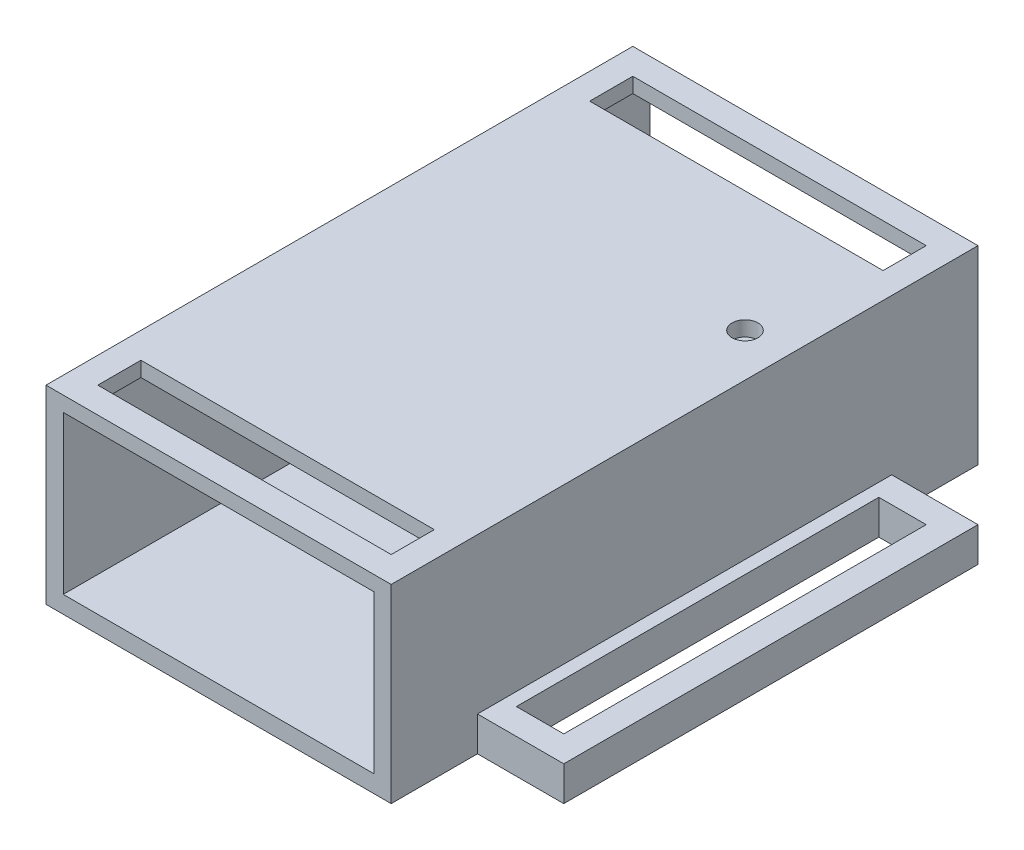
ISO-10303-21;
HEADER;
FILE_DESCRIPTION(('STEP AP214'),'2;1');
FILE_NAME('part.step','',(''),(''),'','','');
FILE_SCHEMA(('AUTOMOTIVE_DESIGN { 1 0 10303 214 1 1 1 1 }'));
ENDSEC;
DATA;
#1=APPLICATION_CONTEXT('core data for automotive mechanical design processes');
#2=APPLICATION_PROTOCOL_DEFINITION('international standard','automotive_design',2000,#1);
#3=PRODUCT_CONTEXT('',#1,'mechanical');
#4=PRODUCT('Part','Part','',(#3));
#5=PRODUCT_RELATED_PRODUCT_CATEGORY('part','',(#4));
#6=PRODUCT_DEFINITION_FORMATION('','',#4);
#7=PRODUCT_DEFINITION_CONTEXT('part definition',#1,'design');
#8=PRODUCT_DEFINITION('design','',#6,#7);
#9=PRODUCT_DEFINITION_SHAPE('','',#8);
#10=(LENGTH_UNIT() NAMED_UNIT(*) SI_UNIT(.MILLI.,.METRE.));
#11=(NAMED_UNIT(*) PLANE_ANGLE_UNIT() SI_UNIT($,.RADIAN.));
#12=(NAMED_UNIT(*) SI_UNIT($,.STERADIAN.) SOLID_ANGLE_UNIT());
#13=UNCERTAINTY_MEASURE_WITH_UNIT(LENGTH_MEASURE(1.E-05),#10,'distance_accuracy_value','');
#14=(GEOMETRIC_REPRESENTATION_CONTEXT(3) GLOBAL_UNCERTAINTY_ASSIGNED_CONTEXT((#13)) GLOBAL_UNIT_ASSIGNED_CONTEXT((#10,
#11,#12)) REPRESENTATION_CONTEXT('',''));
#15=CARTESIAN_POINT('',(0.,0.,0.));
#16=DIRECTION('',(0.,0.,1.));
#17=DIRECTION('',(1.,0.,0.));
#18=AXIS2_PLACEMENT_3D('',#15,#16,#17);
#19=CARTESIAN_POINT('',(0.,0.,0.));
#20=DIRECTION('',(0.,1.,0.));
#21=DIRECTION('',(0.,0.,1.));
#22=AXIS2_PLACEMENT_3D('',#19,#20,#21);
#23=PLANE('',#22);
#24=CARTESIAN_POINT('',(35.,0.,22.));
#25=DIRECTION('',(0.,1.,0.));
#26=DIRECTION('',(0.,0.,1.));
#27=AXIS2_PLACEMENT_3D('',#24,#25,#26);
#28=CIRCLE('',#27,1.5);
#29=CARTESIAN_POINT('',(35.,0.,23.5));
#30=VERTEX_POINT('',#29);
#31=EDGE_CURVE('E406',#30,#30,#28,.T.);
#32=ORIENTED_EDGE('',*,*,#31,.T.);
#33=EDGE_LOOP('',(#32));
#34=FACE_BOUND('',#33,.T.);
#35=DIRECTION('',(0.,0.,1.));
#36=VECTOR('',#35,1.);
#37=CARTESIAN_POINT('',(0.,0.,0.));
#38=LINE('',#37,#36);
#39=CARTESIAN_POINT('',(0.,0.,0.));
#40=VERTEX_POINT('',#39);
#41=CARTESIAN_POINT('',(0.,0.,10.));
#42=VERTEX_POINT('',#41);
#43=EDGE_CURVE('E357',#40,#42,#38,.T.);
#44=ORIENTED_EDGE('',*,*,#43,.F.);
#45=DIRECTION('',(-1.,0.,0.));
#46=VECTOR('',#45,1.);
#47=CARTESIAN_POINT('',(0.,0.,0.));
#48=LINE('',#47,#46);
#49=CARTESIAN_POINT('',(40.,0.,0.));
#50=VERTEX_POINT('',#49);
#51=EDGE_CURVE('E374',#50,#40,#48,.T.);
#52=ORIENTED_EDGE('',*,*,#51,.F.);
#53=DIRECTION('',(0.,0.,-1.));
#54=VECTOR('',#53,1.);
#55=CARTESIAN_POINT('',(40.,0.,0.));
#56=LINE('',#55,#54);
#57=CARTESIAN_POINT('',(40.,0.,10.));
#58=VERTEX_POINT('',#57);
#59=EDGE_CURVE('E371',#58,#50,#56,.T.);
#60=ORIENTED_EDGE('',*,*,#59,.F.);
#61=DIRECTION('',(-1.,0.,0.));
#62=VECTOR('',#61,1.);
#63=CARTESIAN_POINT('',(50.,0.,10.));
#64=LINE('',#63,#62);
#65=CARTESIAN_POINT('',(50.,0.,10.));
#66=VERTEX_POINT('',#65);
#67=EDGE_CURVE('E514',#66,#58,#64,.T.);
#68=ORIENTED_EDGE('',*,*,#67,.F.);
#69=DIRECTION('',(0.,0.,-1.));
#70=VECTOR('',#69,1.);
#71=CARTESIAN_POINT('',(50.,0.,58.));
#72=LINE('',#71,#70);
#73=CARTESIAN_POINT('',(50.,0.,58.));
#74=VERTEX_POINT('',#73);
#75=EDGE_CURVE('E339',#74,#66,#72,.T.);
#76=ORIENTED_EDGE('',*,*,#75,.F.);
#77=DIRECTION('',(-1.,0.,0.));
#78=VECTOR('',#77,1.);
#79=CARTESIAN_POINT('',(50.,0.,58.));
#80=LINE('',#79,#78);
#81=CARTESIAN_POINT('',(40.,0.,58.));
#82=VERTEX_POINT('',#81);
#83=EDGE_CURVE('E511',#74,#82,#80,.T.);
#84=ORIENTED_EDGE('',*,*,#83,.T.);
#85=CARTESIAN_POINT('',(40.,0.,68.));
#86=VERTEX_POINT('',#85);
#87=EDGE_CURVE('E380',#86,#82,#56,.T.);
#88=ORIENTED_EDGE('',*,*,#87,.F.);
#89=DIRECTION('',(1.,0.,0.));
#90=VECTOR('',#89,1.);
#91=CARTESIAN_POINT('',(0.,0.,68.));
#92=LINE('',#91,#90);
#93=CARTESIAN_POINT('',(0.,0.,68.));
#94=VERTEX_POINT('',#93);
#95=EDGE_CURVE('E361',#94,#86,#92,.T.);
#96=ORIENTED_EDGE('',*,*,#95,.F.);
#97=CARTESIAN_POINT('',(0.,0.,58.));
#98=VERTEX_POINT('',#97);
#99=EDGE_CURVE('E362',#98,#94,#38,.T.);
#100=ORIENTED_EDGE('',*,*,#99,.F.);
#101=DIRECTION('',(1.,0.,0.));
#102=VECTOR('',#101,1.);
#103=CARTESIAN_POINT('',(-10.,0.,58.));
#104=LINE('',#103,#102);
#105=CARTESIAN_POINT('',(-10.,0.,58.));
#106=VERTEX_POINT('',#105);
#107=EDGE_CURVE('E291',#106,#98,#104,.T.);
#108=ORIENTED_EDGE('',*,*,#107,.F.);
#109=DIRECTION('',(0.,0.,-1.));
#110=VECTOR('',#109,1.);
#111=CARTESIAN_POINT('',(-10.,0.,58.));
#112=LINE('',#111,#110);
#113=CARTESIAN_POINT('',(-10.,0.,10.));
#114=VERTEX_POINT('',#113);
#115=EDGE_CURVE('E289',#106,#114,#112,.T.);
#116=ORIENTED_EDGE('',*,*,#115,.T.);
#117=DIRECTION('',(1.,0.,0.));
#118=VECTOR('',#117,1.);
#119=CARTESIAN_POINT('',(-10.,0.,10.));
#120=LINE('',#119,#118);
#121=EDGE_CURVE('E300',#114,#42,#120,.T.);
#122=ORIENTED_EDGE('',*,*,#121,.T.);
#123=EDGE_LOOP('',(#44,#52,#60,#68,#76,#84,#88,#96,#100,#108,#116,#122));
#124=FACE_BOUND('',#123,.T.);
#125=DIRECTION('',(-1.,0.,0.));
#126=VECTOR('',#125,1.);
#127=CARTESIAN_POINT('',(0.,0.,13.));
#128=LINE('',#127,#126);
#129=CARTESIAN_POINT('',(47.,0.,13.));
#130=VERTEX_POINT('',#129);
#131=CARTESIAN_POINT('',(41.5091091487596,0.,13.));
#132=VERTEX_POINT('',#131);
#133=EDGE_CURVE('E329',#130,#132,#128,.T.);
#134=ORIENTED_EDGE('',*,*,#133,.T.);
#135=DIRECTION('',(0.,0.,1.));
#136=VECTOR('',#135,1.);
#137=CARTESIAN_POINT('',(41.5091091487596,0.,0.));
#138=LINE('',#137,#136);
#139=CARTESIAN_POINT('',(41.5091091487596,0.,55.));
#140=VERTEX_POINT('',#139);
#141=EDGE_CURVE('E332',#132,#140,#138,.T.);
#142=ORIENTED_EDGE('',*,*,#141,.T.);
#143=DIRECTION('',(1.,0.,0.));
#144=VECTOR('',#143,1.);
#145=CARTESIAN_POINT('',(0.,0.,55.));
#146=LINE('',#145,#144);
#147=CARTESIAN_POINT('',(47.,0.,55.));
#148=VERTEX_POINT('',#147);
#149=EDGE_CURVE('E317',#140,#148,#146,.T.);
#150=ORIENTED_EDGE('',*,*,#149,.T.);
#151=DIRECTION('',(0.,0.,-1.));
#152=VECTOR('',#151,1.);
#153=CARTESIAN_POINT('',(47.,0.,0.));
#154=LINE('',#153,#152);
#155=EDGE_CURVE('E326',#148,#130,#154,.T.);
#156=ORIENTED_EDGE('',*,*,#155,.T.);
#157=EDGE_LOOP('',(#134,#142,#150,#156));
#158=FACE_BOUND('',#157,.T.);
#159=DIRECTION('',(0.,0.,1.));
#160=VECTOR('',#159,1.);
#161=CARTESIAN_POINT('',(-1.50910914875956,0.,0.));
#162=LINE('',#161,#160);
#163=CARTESIAN_POINT('',(-1.50910914875956,0.,13.));
#164=VERTEX_POINT('',#163);
#165=CARTESIAN_POINT('',(-1.50910914875956,0.,55.));
#166=VERTEX_POINT('',#165);
#167=EDGE_CURVE('E277',#164,#166,#162,.T.);
#168=ORIENTED_EDGE('',*,*,#167,.F.);
#169=DIRECTION('',(1.,0.,0.));
#170=VECTOR('',#169,1.);
#171=CARTESIAN_POINT('',(0.,0.,13.));
#172=LINE('',#171,#170);
#173=CARTESIAN_POINT('',(-7.,0.,13.));
#174=VERTEX_POINT('',#173);
#175=EDGE_CURVE('E270',#174,#164,#172,.T.);
#176=ORIENTED_EDGE('',*,*,#175,.F.);
#177=DIRECTION('',(0.,0.,-1.));
#178=VECTOR('',#177,1.);
#179=CARTESIAN_POINT('',(-7.,0.,0.));
#180=LINE('',#179,#178);
#181=CARTESIAN_POINT('',(-7.00000000000001,0.,55.));
#182=VERTEX_POINT('',#181);
#183=EDGE_CURVE('E251',#182,#174,#180,.T.);
#184=ORIENTED_EDGE('',*,*,#183,.F.);
#185=DIRECTION('',(-1.,0.,0.));
#186=VECTOR('',#185,1.);
#187=CARTESIAN_POINT('',(0.,0.,55.));
#188=LINE('',#187,#186);
#189=EDGE_CURVE('E275',#166,#182,#188,.T.);
#190=ORIENTED_EDGE('',*,*,#189,.F.);
#191=EDGE_LOOP('',(#168,#176,#184,#190));
#192=FACE_BOUND('',#191,.T.);
#193=ADVANCED_FACE('F33',(#34,#124,#158,#192),#23,.F.);
#194=CARTESIAN_POINT('',(-10.,4.,58.));
#195=DIRECTION('',(0.,1.,0.));
#196=DIRECTION('',(0.,0.,1.));
#197=AXIS2_PLACEMENT_3D('',#194,#195,#196);
#198=PLANE('',#197);
#199=DIRECTION('',(0.,0.,1.));
#200=VECTOR('',#199,1.);
#201=CARTESIAN_POINT('',(0.,4.,58.));
#202=LINE('',#201,#200);
#203=CARTESIAN_POINT('',(0.,4.,10.));
#204=VERTEX_POINT('',#203);
#205=CARTESIAN_POINT('',(0.,4.,58.));
#206=VERTEX_POINT('',#205);
#207=EDGE_CURVE('E294',#204,#206,#202,.T.);
#208=ORIENTED_EDGE('',*,*,#207,.F.);
#209=DIRECTION('',(1.,0.,0.));
#210=VECTOR('',#209,1.);
#211=CARTESIAN_POINT('',(-10.,4.,10.));
#212=LINE('',#211,#210);
#213=CARTESIAN_POINT('',(-10.,4.,10.));
#214=VERTEX_POINT('',#213);
#215=EDGE_CURVE('E297',#214,#204,#212,.T.);
#216=ORIENTED_EDGE('',*,*,#215,.F.);
#217=DIRECTION('',(0.,0.,1.));
#218=VECTOR('',#217,1.);
#219=CARTESIAN_POINT('',(-10.,4.,58.));
#220=LINE('',#219,#218);
#221=CARTESIAN_POINT('',(-10.,4.,58.));
#222=VERTEX_POINT('',#221);
#223=EDGE_CURVE('E282',#214,#222,#220,.T.);
#224=ORIENTED_EDGE('',*,*,#223,.T.);
#225=DIRECTION('',(1.,0.,0.));
#226=VECTOR('',#225,1.);
#227=CARTESIAN_POINT('',(-10.,4.,58.));
#228=LINE('',#227,#226);
#229=EDGE_CURVE('E299',#222,#206,#228,.T.);
#230=ORIENTED_EDGE('',*,*,#229,.T.);
#231=EDGE_LOOP('',(#208,#216,#224,#230));
#232=FACE_BOUND('',#231,.T.);
#233=DIRECTION('',(1.,0.,0.));
#234=VECTOR('',#233,1.);
#235=CARTESIAN_POINT('',(-1.50910914875956,4.,13.));
#236=LINE('',#235,#234);
#237=CARTESIAN_POINT('',(-7.,4.,13.));
#238=VERTEX_POINT('',#237);
#239=CARTESIAN_POINT('',(-1.50910914875956,4.,13.));
#240=VERTEX_POINT('',#239);
#241=EDGE_CURVE('E257',#238,#240,#236,.T.);
#242=ORIENTED_EDGE('',*,*,#241,.T.);
#243=DIRECTION('',(0.,0.,1.));
#244=VECTOR('',#243,1.);
#245=CARTESIAN_POINT('',(-1.50910914875956,4.,13.));
#246=LINE('',#245,#244);
#247=CARTESIAN_POINT('',(-1.50910914875956,4.,55.));
#248=VERTEX_POINT('',#247);
#249=EDGE_CURVE('E59',#240,#248,#246,.T.);
#250=ORIENTED_EDGE('',*,*,#249,.T.);
#251=DIRECTION('',(-1.,0.,0.));
#252=VECTOR('',#251,1.);
#253=CARTESIAN_POINT('',(-1.50910914875956,4.,55.));
#254=LINE('',#253,#252);
#255=CARTESIAN_POINT('',(-7.00000000000001,4.,55.));
#256=VERTEX_POINT('',#255);
#257=EDGE_CURVE('E263',#248,#256,#254,.T.);
#258=ORIENTED_EDGE('',*,*,#257,.T.);
#259=DIRECTION('',(0.,0.,-1.));
#260=VECTOR('',#259,1.);
#261=CARTESIAN_POINT('',(-7.,4.,13.));
#262=LINE('',#261,#260);
#263=EDGE_CURVE('E248',#256,#238,#262,.T.);
#264=ORIENTED_EDGE('',*,*,#263,.T.);
#265=EDGE_LOOP('',(#242,#250,#258,#264));
#266=FACE_BOUND('',#265,.T.);
#267=ADVANCED_FACE('F261',(#232,#266),#198,.T.);
#268=CARTESIAN_POINT('',(40.,22.,0.));
#269=DIRECTION('',(-1.,0.,0.));
#270=DIRECTION('',(0.,0.,1.));
#271=AXIS2_PLACEMENT_3D('',#268,#269,#270);
#272=PLANE('',#271);
#273=DIRECTION('',(0.,-1.,0.));
#274=VECTOR('',#273,1.);
#275=CARTESIAN_POINT('',(40.,4.,58.));
#276=LINE('',#275,#274);
#277=CARTESIAN_POINT('',(40.,4.,58.));
#278=VERTEX_POINT('',#277);
#279=EDGE_CURVE('E335',#278,#82,#276,.T.);
#280=ORIENTED_EDGE('',*,*,#279,.F.);
#281=DIRECTION('',(0.,0.,1.));
#282=VECTOR('',#281,1.);
#283=CARTESIAN_POINT('',(40.,4.,58.));
#284=LINE('',#283,#282);
#285=CARTESIAN_POINT('',(40.,4.,10.));
#286=VERTEX_POINT('',#285);
#287=EDGE_CURVE('E340',#286,#278,#284,.T.);
#288=ORIENTED_EDGE('',*,*,#287,.F.);
#289=DIRECTION('',(0.,1.,0.));
#290=VECTOR('',#289,1.);
#291=CARTESIAN_POINT('',(40.,4.,10.));
#292=LINE('',#291,#290);
#293=EDGE_CURVE('E354',#58,#286,#292,.T.);
#294=ORIENTED_EDGE('',*,*,#293,.F.);
#295=ORIENTED_EDGE('',*,*,#59,.T.);
#296=DIRECTION('',(0.,-1.,0.));
#297=VECTOR('',#296,1.);
#298=CARTESIAN_POINT('',(40.,22.,0.));
#299=LINE('',#298,#297);
#300=CARTESIAN_POINT('',(40.,22.,0.));
#301=VERTEX_POINT('',#300);
#302=EDGE_CURVE('E416',#301,#50,#299,.T.);
#303=ORIENTED_EDGE('',*,*,#302,.F.);
#304=DIRECTION('',(0.,0.,-1.));
#305=VECTOR('',#304,1.);
#306=CARTESIAN_POINT('',(40.,22.,0.));
#307=LINE('',#306,#305);
#308=CARTESIAN_POINT('',(40.,22.,68.));
#309=VERTEX_POINT('',#308);
#310=EDGE_CURVE('E424',#309,#301,#307,.T.);
#311=ORIENTED_EDGE('',*,*,#310,.F.);
#312=DIRECTION('',(0.,-1.,0.));
#313=VECTOR('',#312,1.);
#314=CARTESIAN_POINT('',(40.,22.,68.));
#315=LINE('',#314,#313);
#316=EDGE_CURVE('E413',#309,#86,#315,.T.);
#317=ORIENTED_EDGE('',*,*,#316,.T.);
#318=ORIENTED_EDGE('',*,*,#87,.T.);
#319=EDGE_LOOP('',(#280,#288,#294,#295,#303,#311,#317,#318));
#320=FACE_BOUND('',#319,.T.);
#321=ADVANCED_FACE('F562',(#320),#272,.F.);
#322=CARTESIAN_POINT('',(35.,22.,22.));
#323=DIRECTION('',(0.,-1.,0.));
#324=DIRECTION('',(0.,0.,-1.));
#325=AXIS2_PLACEMENT_3D('',#322,#323,#324);
#326=CYLINDRICAL_SURFACE('',#325,1.5);
#327=CARTESIAN_POINT('',(35.,20.2658714983277,22.));
#328=DIRECTION('',(0.,1.,0.));
#329=DIRECTION('',(0.,0.,1.));
#330=AXIS2_PLACEMENT_3D('',#327,#328,#329);
#331=CIRCLE('',#330,1.5);
#332=CARTESIAN_POINT('',(35.,20.2658714983277,23.5));
#333=VERTEX_POINT('',#332);
#334=EDGE_CURVE('E403',#333,#333,#331,.T.);
#335=ORIENTED_EDGE('',*,*,#334,.F.);
#336=EDGE_LOOP('',(#335));
#337=FACE_BOUND('',#336,.T.);
#338=CARTESIAN_POINT('',(35.,22.,22.));
#339=DIRECTION('',(0.,1.,0.));
#340=DIRECTION('',(0.,0.,1.));
#341=AXIS2_PLACEMENT_3D('',#338,#339,#340);
#342=CIRCLE('',#341,1.5);
#343=CARTESIAN_POINT('',(35.,22.,23.5));
#344=VERTEX_POINT('',#343);
#345=EDGE_CURVE('E437',#344,#344,#342,.T.);
#346=ORIENTED_EDGE('',*,*,#345,.T.);
#347=EDGE_LOOP('',(#346));
#348=FACE_BOUND('',#347,.T.);
#349=ADVANCED_FACE('F576',(#337,#348),#326,.F.);
#350=CARTESIAN_POINT('',(0.,22.,0.));
#351=DIRECTION('',(0.,1.,0.));
#352=DIRECTION('',(0.,0.,1.));
#353=AXIS2_PLACEMENT_3D('',#350,#351,#352);
#354=PLANE('',#353);
#355=DIRECTION('',(1.,0.,0.));
#356=VECTOR('',#355,1.);
#357=CARTESIAN_POINT('',(3.00000000000001,22.,8.));
#358=LINE('',#357,#356);
#359=CARTESIAN_POINT('',(3.00000000000001,22.,8.));
#360=VERTEX_POINT('',#359);
#361=CARTESIAN_POINT('',(37.,22.,8.));
#362=VERTEX_POINT('',#361);
#363=EDGE_CURVE('E509',#360,#362,#358,.T.);
#364=ORIENTED_EDGE('',*,*,#363,.F.);
#365=DIRECTION('',(0.,0.,1.));
#366=VECTOR('',#365,1.);
#367=CARTESIAN_POINT('',(3.00000000000001,22.,8.));
#368=LINE('',#367,#366);
#369=CARTESIAN_POINT('',(3.00000000000001,22.,3.));
#370=VERTEX_POINT('',#369);
#371=EDGE_CURVE('E496',#370,#360,#368,.T.);
#372=ORIENTED_EDGE('',*,*,#371,.F.);
#373=DIRECTION('',(-1.,0.,0.));
#374=VECTOR('',#373,1.);
#375=CARTESIAN_POINT('',(37.,22.,3.));
#376=LINE('',#375,#374);
#377=CARTESIAN_POINT('',(37.,22.,3.));
#378=VERTEX_POINT('',#377);
#379=EDGE_CURVE('E503',#378,#370,#376,.T.);
#380=ORIENTED_EDGE('',*,*,#379,.F.);
#381=DIRECTION('',(0.,0.,-1.));
#382=VECTOR('',#381,1.);
#383=CARTESIAN_POINT('',(37.,22.,8.));
#384=LINE('',#383,#382);
#385=EDGE_CURVE('E506',#362,#378,#384,.T.);
#386=ORIENTED_EDGE('',*,*,#385,.F.);
#387=EDGE_LOOP('',(#364,#372,#380,#386));
#388=FACE_BOUND('',#387,.T.);
#389=DIRECTION('',(0.,0.,1.));
#390=VECTOR('',#389,1.);
#391=CARTESIAN_POINT('',(3.00000000000001,22.,60.));
#392=LINE('',#391,#390);
#393=CARTESIAN_POINT('',(3.00000000000001,22.,60.));
#394=VERTEX_POINT('',#393);
#395=CARTESIAN_POINT('',(3.00000000000001,22.,65.));
#396=VERTEX_POINT('',#395);
#397=EDGE_CURVE('E489',#394,#396,#392,.T.);
#398=ORIENTED_EDGE('',*,*,#397,.F.);
#399=DIRECTION('',(-1.,0.,0.));
#400=VECTOR('',#399,1.);
#401=CARTESIAN_POINT('',(3.00000000000001,22.,60.));
#402=LINE('',#401,#400);
#403=CARTESIAN_POINT('',(37.,22.,60.));
#404=VERTEX_POINT('',#403);
#405=EDGE_CURVE('E476',#404,#394,#402,.T.);
#406=ORIENTED_EDGE('',*,*,#405,.F.);
#407=DIRECTION('',(0.,0.,-1.));
#408=VECTOR('',#407,1.);
#409=CARTESIAN_POINT('',(37.,22.,60.));
#410=LINE('',#409,#408);
#411=CARTESIAN_POINT('',(37.,22.,65.));
#412=VERTEX_POINT('',#411);
#413=EDGE_CURVE('E483',#412,#404,#410,.T.);
#414=ORIENTED_EDGE('',*,*,#413,.F.);
#415=DIRECTION('',(1.,0.,0.));
#416=VECTOR('',#415,1.);
#417=CARTESIAN_POINT('',(37.,22.,65.));
#418=LINE('',#417,#416);
#419=EDGE_CURVE('E486',#396,#412,#418,.T.);
#420=ORIENTED_EDGE('',*,*,#419,.F.);
#421=EDGE_LOOP('',(#398,#406,#414,#420));
#422=FACE_BOUND('',#421,.T.);
#423=DIRECTION('',(0.,0.,1.));
#424=VECTOR('',#423,1.);
#425=CARTESIAN_POINT('',(0.,22.,0.));
#426=LINE('',#425,#424);
#427=CARTESIAN_POINT('',(0.,22.,0.));
#428=VERTEX_POINT('',#427);
#429=CARTESIAN_POINT('',(0.,22.,68.));
#430=VERTEX_POINT('',#429);
#431=EDGE_CURVE('E431',#428,#430,#426,.T.);
#432=ORIENTED_EDGE('',*,*,#431,.T.);
#433=DIRECTION('',(1.,0.,0.));
#434=VECTOR('',#433,1.);
#435=CARTESIAN_POINT('',(0.,22.,68.));
#436=LINE('',#435,#434);
#437=EDGE_CURVE('E428',#430,#309,#436,.T.);
#438=ORIENTED_EDGE('',*,*,#437,.T.);
#439=ORIENTED_EDGE('',*,*,#310,.T.);
#440=DIRECTION('',(-1.,0.,0.));
#441=VECTOR('',#440,1.);
#442=CARTESIAN_POINT('',(0.,22.,0.));
#443=LINE('',#442,#441);
#444=EDGE_CURVE('E367',#301,#428,#443,.T.);
#445=ORIENTED_EDGE('',*,*,#444,.T.);
#446=EDGE_LOOP('',(#432,#438,#439,#445));
#447=FACE_BOUND('',#446,.T.);
#448=ORIENTED_EDGE('',*,*,#345,.F.);
#449=EDGE_LOOP('',(#448));
#450=FACE_BOUND('',#449,.T.);
#451=ADVANCED_FACE('F567',(#388,#422,#447,#450),#354,.T.);
#452=CARTESIAN_POINT('',(0.,22.,0.));
#453=DIRECTION('',(1.,0.,0.));
#454=DIRECTION('',(0.,0.,-1.));
#455=AXIS2_PLACEMENT_3D('',#452,#453,#454);
#456=PLANE('',#455);
#457=ORIENTED_EDGE('',*,*,#207,.T.);
#458=DIRECTION('',(0.,-1.,0.));
#459=VECTOR('',#458,1.);
#460=CARTESIAN_POINT('',(0.,4.,58.));
#461=LINE('',#460,#459);
#462=EDGE_CURVE('E37',#206,#98,#461,.T.);
#463=ORIENTED_EDGE('',*,*,#462,.T.);
#464=ORIENTED_EDGE('',*,*,#99,.T.);
#465=DIRECTION('',(0.,-1.,0.));
#466=VECTOR('',#465,1.);
#467=CARTESIAN_POINT('',(0.,22.,68.));
#468=LINE('',#467,#466);
#469=EDGE_CURVE('E402',#430,#94,#468,.T.);
#470=ORIENTED_EDGE('',*,*,#469,.F.);
#471=ORIENTED_EDGE('',*,*,#431,.F.);
#472=DIRECTION('',(0.,-1.,0.));
#473=VECTOR('',#472,1.);
#474=CARTESIAN_POINT('',(0.,22.,0.));
#475=LINE('',#474,#473);
#476=EDGE_CURVE('E418',#428,#40,#475,.T.);
#477=ORIENTED_EDGE('',*,*,#476,.T.);
#478=ORIENTED_EDGE('',*,*,#43,.T.);
#479=DIRECTION('',(0.,1.,0.));
#480=VECTOR('',#479,1.);
#481=CARTESIAN_POINT('',(0.,4.,10.));
#482=LINE('',#481,#480);
#483=EDGE_CURVE('E283',#42,#204,#482,.T.);
#484=ORIENTED_EDGE('',*,*,#483,.T.);
#485=EDGE_LOOP('',(#457,#463,#464,#470,#471,#477,#478,#484));
#486=FACE_BOUND('',#485,.T.);
#487=ADVANCED_FACE('F35',(#486),#456,.F.);
#488=CARTESIAN_POINT('',(0.,22.,68.));
#489=DIRECTION('',(0.,0.,-1.));
#490=DIRECTION('',(-1.,0.,0.));
#491=AXIS2_PLACEMENT_3D('',#488,#489,#490);
#492=PLANE('',#491);
#493=DIRECTION('',(1.,0.,0.));
#494=VECTOR('',#493,1.);
#495=CARTESIAN_POINT('',(2.00000000000001,2.,68.));
#496=LINE('',#495,#494);
#497=CARTESIAN_POINT('',(2.00000000000001,2.,68.));
#498=VERTEX_POINT('',#497);
#499=CARTESIAN_POINT('',(38.,2.,68.));
#500=VERTEX_POINT('',#499);
#501=EDGE_CURVE('E456',#498,#500,#496,.T.);
#502=ORIENTED_EDGE('',*,*,#501,.F.);
#503=DIRECTION('',(0.,-1.,0.));
#504=VECTOR('',#503,1.);
#505=CARTESIAN_POINT('',(2.00000000000001,20.2658714983277,68.));
#506=LINE('',#505,#504);
#507=CARTESIAN_POINT('',(2.00000000000001,20.2658714983277,68.));
#508=VERTEX_POINT('',#507);
#509=EDGE_CURVE('E459',#508,#498,#506,.T.);
#510=ORIENTED_EDGE('',*,*,#509,.F.);
#511=DIRECTION('',(-1.,0.,0.));
#512=VECTOR('',#511,1.);
#513=CARTESIAN_POINT('',(38.,20.2658714983277,68.));
#514=LINE('',#513,#512);
#515=CARTESIAN_POINT('',(38.,20.2658714983277,68.));
#516=VERTEX_POINT('',#515);
#517=EDGE_CURVE('E449',#516,#508,#514,.T.);
#518=ORIENTED_EDGE('',*,*,#517,.F.);
#519=DIRECTION('',(0.,1.,0.));
#520=VECTOR('',#519,1.);
#521=CARTESIAN_POINT('',(38.,2.,68.));
#522=LINE('',#521,#520);
#523=EDGE_CURVE('E453',#500,#516,#522,.T.);
#524=ORIENTED_EDGE('',*,*,#523,.F.);
#525=EDGE_LOOP('',(#502,#510,#518,#524));
#526=FACE_BOUND('',#525,.T.);
#527=ORIENTED_EDGE('',*,*,#95,.T.);
#528=ORIENTED_EDGE('',*,*,#316,.F.);
#529=ORIENTED_EDGE('',*,*,#437,.F.);
#530=ORIENTED_EDGE('',*,*,#469,.T.);
#531=EDGE_LOOP('',(#527,#528,#529,#530));
#532=FACE_BOUND('',#531,.T.);
#533=ADVANCED_FACE('F573',(#526,#532),#492,.F.);
#534=CARTESIAN_POINT('',(0.,22.,0.));
#535=DIRECTION('',(0.,0.,1.));
#536=DIRECTION('',(1.,0.,0.));
#537=AXIS2_PLACEMENT_3D('',#534,#535,#536);
#538=PLANE('',#537);
#539=DIRECTION('',(-1.,0.,0.));
#540=VECTOR('',#539,1.);
#541=CARTESIAN_POINT('',(38.,20.2658714983277,0.));
#542=LINE('',#541,#540);
#543=CARTESIAN_POINT('',(38.,20.2658714983277,0.));
#544=VERTEX_POINT('',#543);
#545=CARTESIAN_POINT('',(2.00000000000001,20.2658714983277,0.));
#546=VERTEX_POINT('',#545);
#547=EDGE_CURVE('E444',#544,#546,#542,.T.);
#548=ORIENTED_EDGE('',*,*,#547,.T.);
#549=DIRECTION('',(0.,-1.,0.));
#550=VECTOR('',#549,1.);
#551=CARTESIAN_POINT('',(2.00000000000001,20.2658714983277,0.));
#552=LINE('',#551,#550);
#553=CARTESIAN_POINT('',(2.00000000000001,2.,0.));
#554=VERTEX_POINT('',#553);
#555=EDGE_CURVE('E452',#546,#554,#552,.T.);
#556=ORIENTED_EDGE('',*,*,#555,.T.);
#557=DIRECTION('',(1.,0.,0.));
#558=VECTOR('',#557,1.);
#559=CARTESIAN_POINT('',(2.00000000000001,2.,0.));
#560=LINE('',#559,#558);
#561=CARTESIAN_POINT('',(38.,2.,0.));
#562=VERTEX_POINT('',#561);
#563=EDGE_CURVE('E467',#554,#562,#560,.T.);
#564=ORIENTED_EDGE('',*,*,#563,.T.);
#565=DIRECTION('',(0.,1.,0.));
#566=VECTOR('',#565,1.);
#567=CARTESIAN_POINT('',(38.,2.,0.));
#568=LINE('',#567,#566);
#569=EDGE_CURVE('E464',#562,#544,#568,.T.);
#570=ORIENTED_EDGE('',*,*,#569,.T.);
#571=EDGE_LOOP('',(#548,#556,#564,#570));
#572=FACE_BOUND('',#571,.T.);
#573=ORIENTED_EDGE('',*,*,#51,.T.);
#574=ORIENTED_EDGE('',*,*,#476,.F.);
#575=ORIENTED_EDGE('',*,*,#444,.F.);
#576=ORIENTED_EDGE('',*,*,#302,.T.);
#577=EDGE_LOOP('',(#573,#574,#575,#576));
#578=FACE_BOUND('',#577,.T.);
#579=ADVANCED_FACE('F569',(#572,#578),#538,.F.);
#580=CARTESIAN_POINT('',(35.,2.,22.));
#581=DIRECTION('',(0.,-1.,0.));
#582=DIRECTION('',(0.,0.,-1.));
#583=AXIS2_PLACEMENT_3D('',#580,#581,#582);
#584=CIRCLE('',#583,1.5);
#585=CARTESIAN_POINT('',(35.,2.,20.5));
#586=VERTEX_POINT('',#585);
#587=EDGE_CURVE('E407',#586,#586,#584,.T.);
#588=ORIENTED_EDGE('',*,*,#587,.F.);
#589=EDGE_LOOP('',(#588));
#590=FACE_BOUND('',#589,.T.);
#591=ORIENTED_EDGE('',*,*,#31,.F.);
#592=EDGE_LOOP('',(#591));
#593=FACE_BOUND('',#592,.T.);
#594=ADVANCED_FACE('F572',(#590,#593),#326,.F.);
#595=CARTESIAN_POINT('',(2.00000000000001,20.2658714983277,0.));
#596=DIRECTION('',(-1.,0.,0.));
#597=DIRECTION('',(0.,0.,1.));
#598=AXIS2_PLACEMENT_3D('',#595,#596,#597);
#599=PLANE('',#598);
#600=ORIENTED_EDGE('',*,*,#509,.T.);
#601=DIRECTION('',(0.,0.,1.));
#602=VECTOR('',#601,1.);
#603=CARTESIAN_POINT('',(2.00000000000001,2.,0.));
#604=LINE('',#603,#602);
#605=EDGE_CURVE('E440',#554,#498,#604,.T.);
#606=ORIENTED_EDGE('',*,*,#605,.F.);
#607=ORIENTED_EDGE('',*,*,#555,.F.);
#608=DIRECTION('',(0.,0.,1.));
#609=VECTOR('',#608,1.);
#610=CARTESIAN_POINT('',(2.00000000000001,20.2658714983277,0.));
#611=LINE('',#610,#609);
#612=EDGE_CURVE('E410',#546,#508,#611,.T.);
#613=ORIENTED_EDGE('',*,*,#612,.T.);
#614=EDGE_LOOP('',(#600,#606,#607,#613));
#615=FACE_BOUND('',#614,.T.);
#616=ADVANCED_FACE('F603',(#615),#599,.F.);
#617=CARTESIAN_POINT('',(38.,20.2658714983277,0.));
#618=DIRECTION('',(0.,1.,0.));
#619=DIRECTION('',(0.,0.,1.));
#620=AXIS2_PLACEMENT_3D('',#617,#618,#619);
#621=PLANE('',#620);
#622=DIRECTION('',(0.,0.,1.));
#623=VECTOR('',#622,1.);
#624=CARTESIAN_POINT('',(3.00000000000001,20.2658714983277,0.));
#625=LINE('',#624,#623);
#626=CARTESIAN_POINT('',(3.00000000000001,20.2658714983277,3.));
#627=VERTEX_POINT('',#626);
#628=CARTESIAN_POINT('',(3.00000000000001,20.2658714983277,8.));
#629=VERTEX_POINT('',#628);
#630=EDGE_CURVE('E43',#627,#629,#625,.T.);
#631=ORIENTED_EDGE('',*,*,#630,.T.);
#632=DIRECTION('',(1.,0.,0.));
#633=VECTOR('',#632,1.);
#634=CARTESIAN_POINT('',(38.,20.2658714983277,8.));
#635=LINE('',#634,#633);
#636=CARTESIAN_POINT('',(37.,20.2658714983277,8.));
#637=VERTEX_POINT('',#636);
#638=EDGE_CURVE('E11',#629,#637,#635,.T.);
#639=ORIENTED_EDGE('',*,*,#638,.T.);
#640=DIRECTION('',(0.,0.,-1.));
#641=VECTOR('',#640,1.);
#642=CARTESIAN_POINT('',(37.,20.2658714983277,0.));
#643=LINE('',#642,#641);
#644=CARTESIAN_POINT('',(37.,20.2658714983277,3.));
#645=VERTEX_POINT('',#644);
#646=EDGE_CURVE('E387',#637,#645,#643,.T.);
#647=ORIENTED_EDGE('',*,*,#646,.T.);
#648=DIRECTION('',(-1.,0.,0.));
#649=VECTOR('',#648,1.);
#650=CARTESIAN_POINT('',(38.,20.2658714983277,3.));
#651=LINE('',#650,#649);
#652=EDGE_CURVE('E384',#645,#627,#651,.T.);
#653=ORIENTED_EDGE('',*,*,#652,.T.);
#654=EDGE_LOOP('',(#631,#639,#647,#653));
#655=FACE_BOUND('',#654,.T.);
#656=DIRECTION('',(-1.,0.,0.));
#657=VECTOR('',#656,1.);
#658=CARTESIAN_POINT('',(38.,20.2658714983277,60.));
#659=LINE('',#658,#657);
#660=CARTESIAN_POINT('',(37.,20.2658714983277,60.));
#661=VERTEX_POINT('',#660);
#662=CARTESIAN_POINT('',(3.00000000000001,20.2658714983277,60.));
#663=VERTEX_POINT('',#662);
#664=EDGE_CURVE('E393',#661,#663,#659,.T.);
#665=ORIENTED_EDGE('',*,*,#664,.T.);
#666=DIRECTION('',(0.,0.,1.));
#667=VECTOR('',#666,1.);
#668=CARTESIAN_POINT('',(3.00000000000001,20.2658714983277,0.));
#669=LINE('',#668,#667);
#670=CARTESIAN_POINT('',(3.00000000000001,20.2658714983277,65.));
#671=VERTEX_POINT('',#670);
#672=EDGE_CURVE('E390',#663,#671,#669,.T.);
#673=ORIENTED_EDGE('',*,*,#672,.T.);
#674=DIRECTION('',(1.,0.,0.));
#675=VECTOR('',#674,1.);
#676=CARTESIAN_POINT('',(38.,20.2658714983277,65.));
#677=LINE('',#676,#675);
#678=CARTESIAN_POINT('',(37.,20.2658714983277,65.));
#679=VERTEX_POINT('',#678);
#680=EDGE_CURVE('E399',#671,#679,#677,.T.);
#681=ORIENTED_EDGE('',*,*,#680,.T.);
#682=DIRECTION('',(0.,0.,-1.));
#683=VECTOR('',#682,1.);
#684=CARTESIAN_POINT('',(37.,20.2658714983277,0.));
#685=LINE('',#684,#683);
#686=EDGE_CURVE('E396',#679,#661,#685,.T.);
#687=ORIENTED_EDGE('',*,*,#686,.T.);
#688=EDGE_LOOP('',(#665,#673,#681,#687));
#689=FACE_BOUND('',#688,.T.);
#690=ORIENTED_EDGE('',*,*,#334,.T.);
#691=EDGE_LOOP('',(#690));
#692=FACE_BOUND('',#691,.T.);
#693=ORIENTED_EDGE('',*,*,#517,.T.);
#694=ORIENTED_EDGE('',*,*,#612,.F.);
#695=ORIENTED_EDGE('',*,*,#547,.F.);
#696=DIRECTION('',(0.,0.,1.));
#697=VECTOR('',#696,1.);
#698=CARTESIAN_POINT('',(38.,20.2658714983277,0.));
#699=LINE('',#698,#697);
#700=EDGE_CURVE('E446',#544,#516,#699,.T.);
#701=ORIENTED_EDGE('',*,*,#700,.T.);
#702=EDGE_LOOP('',(#693,#694,#695,#701));
#703=FACE_BOUND('',#702,.T.);
#704=ADVANCED_FACE('F608',(#655,#689,#692,#703),#621,.F.);
#705=CARTESIAN_POINT('',(38.,2.,0.));
#706=DIRECTION('',(1.,0.,0.));
#707=DIRECTION('',(0.,0.,-1.));
#708=AXIS2_PLACEMENT_3D('',#705,#706,#707);
#709=PLANE('',#708);
#710=ORIENTED_EDGE('',*,*,#523,.T.);
#711=ORIENTED_EDGE('',*,*,#700,.F.);
#712=ORIENTED_EDGE('',*,*,#569,.F.);
#713=DIRECTION('',(0.,0.,1.));
#714=VECTOR('',#713,1.);
#715=CARTESIAN_POINT('',(38.,2.,0.));
#716=LINE('',#715,#714);
#717=EDGE_CURVE('E443',#562,#500,#716,.T.);
#718=ORIENTED_EDGE('',*,*,#717,.T.);
#719=EDGE_LOOP('',(#710,#711,#712,#718));
#720=FACE_BOUND('',#719,.T.);
#721=ADVANCED_FACE('F618',(#720),#709,.F.);
#722=CARTESIAN_POINT('',(2.00000000000001,2.,0.));
#723=DIRECTION('',(0.,-1.,0.));
#724=DIRECTION('',(0.,0.,-1.));
#725=AXIS2_PLACEMENT_3D('',#722,#723,#724);
#726=PLANE('',#725);
#727=ORIENTED_EDGE('',*,*,#587,.T.);
#728=EDGE_LOOP('',(#727));
#729=FACE_BOUND('',#728,.T.);
#730=ORIENTED_EDGE('',*,*,#501,.T.);
#731=ORIENTED_EDGE('',*,*,#717,.F.);
#732=ORIENTED_EDGE('',*,*,#563,.F.);
#733=ORIENTED_EDGE('',*,*,#605,.T.);
#734=EDGE_LOOP('',(#730,#731,#732,#733));
#735=FACE_BOUND('',#734,.T.);
#736=ADVANCED_FACE('F614',(#729,#735),#726,.F.);
#737=CARTESIAN_POINT('',(3.00000000000001,20.,60.));
#738=DIRECTION('',(-1.,0.,0.));
#739=DIRECTION('',(0.,0.,1.));
#740=AXIS2_PLACEMENT_3D('',#737,#738,#739);
#741=PLANE('',#740);
#742=DIRECTION('',(0.,1.,0.));
#743=VECTOR('',#742,1.);
#744=CARTESIAN_POINT('',(3.00000000000001,20.,60.));
#745=LINE('',#744,#743);
#746=EDGE_CURVE('E461',#663,#394,#745,.T.);
#747=ORIENTED_EDGE('',*,*,#746,.T.);
#748=ORIENTED_EDGE('',*,*,#397,.T.);
#749=DIRECTION('',(0.,1.,0.));
#750=VECTOR('',#749,1.);
#751=CARTESIAN_POINT('',(3.00000000000001,20.,65.));
#752=LINE('',#751,#750);
#753=EDGE_CURVE('E472',#671,#396,#752,.T.);
#754=ORIENTED_EDGE('',*,*,#753,.F.);
#755=ORIENTED_EDGE('',*,*,#672,.F.);
#756=EDGE_LOOP('',(#747,#748,#754,#755));
#757=FACE_BOUND('',#756,.T.);
#758=ADVANCED_FACE('F617',(#757),#741,.F.);
#759=CARTESIAN_POINT('',(3.00000000000001,20.,60.));
#760=DIRECTION('',(0.,0.,-1.));
#761=DIRECTION('',(-1.,0.,0.));
#762=AXIS2_PLACEMENT_3D('',#759,#760,#761);
#763=PLANE('',#762);
#764=DIRECTION('',(0.,1.,0.));
#765=VECTOR('',#764,1.);
#766=CARTESIAN_POINT('',(37.,20.,60.));
#767=LINE('',#766,#765);
#768=EDGE_CURVE('E478',#661,#404,#767,.T.);
#769=ORIENTED_EDGE('',*,*,#768,.T.);
#770=ORIENTED_EDGE('',*,*,#405,.T.);
#771=ORIENTED_EDGE('',*,*,#746,.F.);
#772=ORIENTED_EDGE('',*,*,#664,.F.);
#773=EDGE_LOOP('',(#769,#770,#771,#772));
#774=FACE_BOUND('',#773,.T.);
#775=ADVANCED_FACE('F638',(#774),#763,.F.);
#776=CARTESIAN_POINT('',(37.,20.,60.));
#777=DIRECTION('',(1.,0.,0.));
#778=DIRECTION('',(0.,0.,-1.));
#779=AXIS2_PLACEMENT_3D('',#776,#777,#778);
#780=PLANE('',#779);
#781=DIRECTION('',(0.,1.,0.));
#782=VECTOR('',#781,1.);
#783=CARTESIAN_POINT('',(37.,20.,65.));
#784=LINE('',#783,#782);
#785=EDGE_CURVE('E475',#679,#412,#784,.T.);
#786=ORIENTED_EDGE('',*,*,#785,.T.);
#787=ORIENTED_EDGE('',*,*,#413,.T.);
#788=ORIENTED_EDGE('',*,*,#768,.F.);
#789=ORIENTED_EDGE('',*,*,#686,.F.);
#790=EDGE_LOOP('',(#786,#787,#788,#789));
#791=FACE_BOUND('',#790,.T.);
#792=ADVANCED_FACE('F644',(#791),#780,.F.);
#793=CARTESIAN_POINT('',(37.,20.,65.));
#794=DIRECTION('',(0.,0.,1.));
#795=DIRECTION('',(1.,0.,0.));
#796=AXIS2_PLACEMENT_3D('',#793,#794,#795);
#797=PLANE('',#796);
#798=ORIENTED_EDGE('',*,*,#753,.T.);
#799=ORIENTED_EDGE('',*,*,#419,.T.);
#800=ORIENTED_EDGE('',*,*,#785,.F.);
#801=ORIENTED_EDGE('',*,*,#680,.F.);
#802=EDGE_LOOP('',(#798,#799,#800,#801));
#803=FACE_BOUND('',#802,.T.);
#804=ADVANCED_FACE('F640',(#803),#797,.F.);
#805=CARTESIAN_POINT('',(3.00000000000001,20.,8.));
#806=DIRECTION('',(0.,0.,1.));
#807=DIRECTION('',(1.,0.,0.));
#808=AXIS2_PLACEMENT_3D('',#805,#806,#807);
#809=PLANE('',#808);
#810=DIRECTION('',(0.,1.,0.));
#811=VECTOR('',#810,1.);
#812=CARTESIAN_POINT('',(3.00000000000001,20.,8.));
#813=LINE('',#812,#811);
#814=EDGE_CURVE('E491',#629,#360,#813,.T.);
#815=ORIENTED_EDGE('',*,*,#814,.T.);
#816=ORIENTED_EDGE('',*,*,#363,.T.);
#817=DIRECTION('',(0.,1.,0.));
#818=VECTOR('',#817,1.);
#819=CARTESIAN_POINT('',(37.,20.,8.));
#820=LINE('',#819,#818);
#821=EDGE_CURVE('E492',#637,#362,#820,.T.);
#822=ORIENTED_EDGE('',*,*,#821,.F.);
#823=ORIENTED_EDGE('',*,*,#638,.F.);
#824=EDGE_LOOP('',(#815,#816,#822,#823));
#825=FACE_BOUND('',#824,.T.);
#826=ADVANCED_FACE('F643',(#825),#809,.F.);
#827=CARTESIAN_POINT('',(3.00000000000001,20.,8.));
#828=DIRECTION('',(-1.,0.,0.));
#829=DIRECTION('',(0.,0.,1.));
#830=AXIS2_PLACEMENT_3D('',#827,#828,#829);
#831=PLANE('',#830);
#832=DIRECTION('',(0.,1.,0.));
#833=VECTOR('',#832,1.);
#834=CARTESIAN_POINT('',(3.00000000000001,20.,3.));
#835=LINE('',#834,#833);
#836=EDGE_CURVE('E498',#627,#370,#835,.T.);
#837=ORIENTED_EDGE('',*,*,#836,.T.);
#838=ORIENTED_EDGE('',*,*,#371,.T.);
#839=ORIENTED_EDGE('',*,*,#814,.F.);
#840=ORIENTED_EDGE('',*,*,#630,.F.);
#841=EDGE_LOOP('',(#837,#838,#839,#840));
#842=FACE_BOUND('',#841,.T.);
#843=ADVANCED_FACE('F654',(#842),#831,.F.);
#844=CARTESIAN_POINT('',(37.,20.,3.));
#845=DIRECTION('',(0.,0.,-1.));
#846=DIRECTION('',(-1.,0.,0.));
#847=AXIS2_PLACEMENT_3D('',#844,#845,#846);
#848=PLANE('',#847);
#849=DIRECTION('',(0.,1.,0.));
#850=VECTOR('',#849,1.);
#851=CARTESIAN_POINT('',(37.,20.,3.));
#852=LINE('',#851,#850);
#853=EDGE_CURVE('E495',#645,#378,#852,.T.);
#854=ORIENTED_EDGE('',*,*,#853,.T.);
#855=ORIENTED_EDGE('',*,*,#379,.T.);
#856=ORIENTED_EDGE('',*,*,#836,.F.);
#857=ORIENTED_EDGE('',*,*,#652,.F.);
#858=EDGE_LOOP('',(#854,#855,#856,#857));
#859=FACE_BOUND('',#858,.T.);
#860=ADVANCED_FACE('F658',(#859),#848,.F.);
#861=CARTESIAN_POINT('',(37.,20.,8.));
#862=DIRECTION('',(1.,0.,0.));
#863=DIRECTION('',(0.,0.,-1.));
#864=AXIS2_PLACEMENT_3D('',#861,#862,#863);
#865=PLANE('',#864);
#866=ORIENTED_EDGE('',*,*,#821,.T.);
#867=ORIENTED_EDGE('',*,*,#385,.T.);
#868=ORIENTED_EDGE('',*,*,#853,.F.);
#869=ORIENTED_EDGE('',*,*,#646,.F.);
#870=EDGE_LOOP('',(#866,#867,#868,#869));
#871=FACE_BOUND('',#870,.T.);
#872=ADVANCED_FACE('F554',(#871),#865,.F.);
#873=CARTESIAN_POINT('',(50.,4.,58.));
#874=DIRECTION('',(0.,0.,-1.));
#875=DIRECTION('',(-1.,0.,0.));
#876=AXIS2_PLACEMENT_3D('',#873,#874,#875);
#877=PLANE('',#876);
#878=ORIENTED_EDGE('',*,*,#279,.T.);
#879=ORIENTED_EDGE('',*,*,#83,.F.);
#880=DIRECTION('',(0.,-1.,0.));
#881=VECTOR('',#880,1.);
#882=CARTESIAN_POINT('',(50.,4.,58.));
#883=LINE('',#882,#881);
#884=CARTESIAN_POINT('',(50.,4.,58.));
#885=VERTEX_POINT('',#884);
#886=EDGE_CURVE('E336',#885,#74,#883,.T.);
#887=ORIENTED_EDGE('',*,*,#886,.F.);
#888=DIRECTION('',(-1.,0.,0.));
#889=VECTOR('',#888,1.);
#890=CARTESIAN_POINT('',(50.,4.,58.));
#891=LINE('',#890,#889);
#892=EDGE_CURVE('E346',#885,#278,#891,.T.);
#893=ORIENTED_EDGE('',*,*,#892,.T.);
#894=EDGE_LOOP('',(#878,#879,#887,#893));
#895=FACE_BOUND('',#894,.T.);
#896=ADVANCED_FACE('F519',(#895),#877,.F.);
#897=CARTESIAN_POINT('',(50.,4.,10.));
#898=DIRECTION('',(0.,0.,1.));
#899=DIRECTION('',(1.,0.,0.));
#900=AXIS2_PLACEMENT_3D('',#897,#898,#899);
#901=PLANE('',#900);
#902=ORIENTED_EDGE('',*,*,#293,.T.);
#903=DIRECTION('',(-1.,0.,0.));
#904=VECTOR('',#903,1.);
#905=CARTESIAN_POINT('',(50.,4.,10.));
#906=LINE('',#905,#904);
#907=CARTESIAN_POINT('',(50.,4.,10.));
#908=VERTEX_POINT('',#907);
#909=EDGE_CURVE('E512',#908,#286,#906,.T.);
#910=ORIENTED_EDGE('',*,*,#909,.F.);
#911=DIRECTION('',(0.,1.,0.));
#912=VECTOR('',#911,1.);
#913=CARTESIAN_POINT('',(50.,4.,10.));
#914=LINE('',#913,#912);
#915=EDGE_CURVE('E342',#66,#908,#914,.T.);
#916=ORIENTED_EDGE('',*,*,#915,.F.);
#917=ORIENTED_EDGE('',*,*,#67,.T.);
#918=EDGE_LOOP('',(#902,#910,#916,#917));
#919=FACE_BOUND('',#918,.T.);
#920=ADVANCED_FACE('F545',(#919),#901,.F.);
#921=CARTESIAN_POINT('',(50.,4.,58.));
#922=DIRECTION('',(0.,-1.,0.));
#923=DIRECTION('',(0.,0.,-1.));
#924=AXIS2_PLACEMENT_3D('',#921,#922,#923);
#925=PLANE('',#924);
#926=DIRECTION('',(1.,0.,0.));
#927=VECTOR('',#926,1.);
#928=CARTESIAN_POINT('',(41.5091091487596,4.,55.));
#929=LINE('',#928,#927);
#930=CARTESIAN_POINT('',(41.5091091487596,4.,55.));
#931=VERTEX_POINT('',#930);
#932=CARTESIAN_POINT('',(47.,4.,55.));
#933=VERTEX_POINT('',#932);
#934=EDGE_CURVE('E305',#931,#933,#929,.T.);
#935=ORIENTED_EDGE('',*,*,#934,.F.);
#936=DIRECTION('',(0.,0.,1.));
#937=VECTOR('',#936,1.);
#938=CARTESIAN_POINT('',(41.5091091487596,4.,13.));
#939=LINE('',#938,#937);
#940=CARTESIAN_POINT('',(41.5091091487596,4.,13.));
#941=VERTEX_POINT('',#940);
#942=EDGE_CURVE('E303',#941,#931,#939,.T.);
#943=ORIENTED_EDGE('',*,*,#942,.F.);
#944=DIRECTION('',(-1.,0.,0.));
#945=VECTOR('',#944,1.);
#946=CARTESIAN_POINT('',(41.5091091487596,4.,13.));
#947=LINE('',#946,#945);
#948=CARTESIAN_POINT('',(47.,4.,13.));
#949=VERTEX_POINT('',#948);
#950=EDGE_CURVE('E311',#949,#941,#947,.T.);
#951=ORIENTED_EDGE('',*,*,#950,.F.);
#952=DIRECTION('',(0.,0.,-1.));
#953=VECTOR('',#952,1.);
#954=CARTESIAN_POINT('',(47.,4.,13.));
#955=LINE('',#954,#953);
#956=EDGE_CURVE('E308',#933,#949,#955,.T.);
#957=ORIENTED_EDGE('',*,*,#956,.F.);
#958=EDGE_LOOP('',(#935,#943,#951,#957));
#959=FACE_BOUND('',#958,.T.);
#960=ORIENTED_EDGE('',*,*,#287,.T.);
#961=ORIENTED_EDGE('',*,*,#892,.F.);
#962=DIRECTION('',(0.,0.,1.));
#963=VECTOR('',#962,1.);
#964=CARTESIAN_POINT('',(50.,4.,58.));
#965=LINE('',#964,#963);
#966=EDGE_CURVE('E344',#908,#885,#965,.T.);
#967=ORIENTED_EDGE('',*,*,#966,.F.);
#968=ORIENTED_EDGE('',*,*,#909,.T.);
#969=EDGE_LOOP('',(#960,#961,#967,#968));
#970=FACE_BOUND('',#969,.T.);
#971=ADVANCED_FACE('F524',(#959,#970),#925,.F.);
#972=CARTESIAN_POINT('',(50.,0.,0.));
#973=DIRECTION('',(1.,0.,0.));
#974=DIRECTION('',(0.,0.,-1.));
#975=AXIS2_PLACEMENT_3D('',#972,#973,#974);
#976=PLANE('',#975);
#977=ORIENTED_EDGE('',*,*,#886,.T.);
#978=ORIENTED_EDGE('',*,*,#75,.T.);
#979=ORIENTED_EDGE('',*,*,#915,.T.);
#980=ORIENTED_EDGE('',*,*,#966,.T.);
#981=EDGE_LOOP('',(#977,#978,#979,#980));
#982=FACE_BOUND('',#981,.T.);
#983=ADVANCED_FACE('F544',(#982),#976,.T.);
#984=CARTESIAN_POINT('',(41.5091091487596,-6.,13.));
#985=DIRECTION('',(-1.,0.,0.));
#986=DIRECTION('',(0.,0.,1.));
#987=AXIS2_PLACEMENT_3D('',#984,#985,#986);
#988=PLANE('',#987);
#989=DIRECTION('',(0.,1.,0.));
#990=VECTOR('',#989,1.);
#991=CARTESIAN_POINT('',(41.5091091487596,-6.,13.));
#992=LINE('',#991,#990);
#993=EDGE_CURVE('E315',#132,#941,#992,.T.);
#994=ORIENTED_EDGE('',*,*,#993,.T.);
#995=ORIENTED_EDGE('',*,*,#942,.T.);
#996=DIRECTION('',(0.,1.,0.));
#997=VECTOR('',#996,1.);
#998=CARTESIAN_POINT('',(41.5091091487596,-6.,55.));
#999=LINE('',#998,#997);
#1000=EDGE_CURVE('E314',#140,#931,#999,.T.);
#1001=ORIENTED_EDGE('',*,*,#1000,.F.);
#1002=ORIENTED_EDGE('',*,*,#141,.F.);
#1003=EDGE_LOOP('',(#994,#995,#1001,#1002));
#1004=FACE_BOUND('',#1003,.T.);
#1005=ADVANCED_FACE('F716',(#1004),#988,.F.);
#1006=CARTESIAN_POINT('',(41.5091091487596,-6.,13.));
#1007=DIRECTION('',(0.,0.,-1.));
#1008=DIRECTION('',(-1.,0.,0.));
#1009=AXIS2_PLACEMENT_3D('',#1006,#1007,#1008);
#1010=PLANE('',#1009);
#1011=DIRECTION('',(0.,1.,0.));
#1012=VECTOR('',#1011,1.);
#1013=CARTESIAN_POINT('',(47.,-6.,13.));
#1014=LINE('',#1013,#1012);
#1015=EDGE_CURVE('E318',#130,#949,#1014,.T.);
#1016=ORIENTED_EDGE('',*,*,#1015,.T.);
#1017=ORIENTED_EDGE('',*,*,#950,.T.);
#1018=ORIENTED_EDGE('',*,*,#993,.F.);
#1019=ORIENTED_EDGE('',*,*,#133,.F.);
#1020=EDGE_LOOP('',(#1016,#1017,#1018,#1019));
#1021=FACE_BOUND('',#1020,.T.);
#1022=ADVANCED_FACE('F730',(#1021),#1010,.F.);
#1023=CARTESIAN_POINT('',(47.,-6.,13.));
#1024=DIRECTION('',(1.,0.,0.));
#1025=DIRECTION('',(0.,0.,-1.));
#1026=AXIS2_PLACEMENT_3D('',#1023,#1024,#1025);
#1027=PLANE('',#1026);
#1028=DIRECTION('',(0.,1.,0.));
#1029=VECTOR('',#1028,1.);
#1030=CARTESIAN_POINT('',(47.,-6.,55.));
#1031=LINE('',#1030,#1029);
#1032=EDGE_CURVE('E320',#148,#933,#1031,.T.);
#1033=ORIENTED_EDGE('',*,*,#1032,.T.);
#1034=ORIENTED_EDGE('',*,*,#956,.T.);
#1035=ORIENTED_EDGE('',*,*,#1015,.F.);
#1036=ORIENTED_EDGE('',*,*,#155,.F.);
#1037=EDGE_LOOP('',(#1033,#1034,#1035,#1036));
#1038=FACE_BOUND('',#1037,.T.);
#1039=ADVANCED_FACE('F740',(#1038),#1027,.F.);
#1040=CARTESIAN_POINT('',(41.5091091487596,-6.,55.));
#1041=DIRECTION('',(0.,0.,1.));
#1042=DIRECTION('',(1.,0.,0.));
#1043=AXIS2_PLACEMENT_3D('',#1040,#1041,#1042);
#1044=PLANE('',#1043);
#1045=ORIENTED_EDGE('',*,*,#1000,.T.);
#1046=ORIENTED_EDGE('',*,*,#934,.T.);
#1047=ORIENTED_EDGE('',*,*,#1032,.F.);
#1048=ORIENTED_EDGE('',*,*,#149,.F.);
#1049=EDGE_LOOP('',(#1045,#1046,#1047,#1048));
#1050=FACE_BOUND('',#1049,.T.);
#1051=ADVANCED_FACE('F750',(#1050),#1044,.F.);
#1052=CARTESIAN_POINT('',(-10.,4.,58.));
#1053=DIRECTION('',(0.,0.,1.));
#1054=DIRECTION('',(1.,0.,0.));
#1055=AXIS2_PLACEMENT_3D('',#1052,#1053,#1054);
#1056=PLANE('',#1055);
#1057=ORIENTED_EDGE('',*,*,#462,.F.);
#1058=ORIENTED_EDGE('',*,*,#229,.F.);
#1059=DIRECTION('',(0.,-1.,0.));
#1060=VECTOR('',#1059,1.);
#1061=CARTESIAN_POINT('',(-10.,4.,58.));
#1062=LINE('',#1061,#1060);
#1063=EDGE_CURVE('E279',#222,#106,#1062,.T.);
#1064=ORIENTED_EDGE('',*,*,#1063,.T.);
#1065=ORIENTED_EDGE('',*,*,#107,.T.);
#1066=EDGE_LOOP('',(#1057,#1058,#1064,#1065));
#1067=FACE_BOUND('',#1066,.T.);
#1068=ADVANCED_FACE('F760',(#1067),#1056,.T.);
#1069=CARTESIAN_POINT('',(-10.,4.,10.));
#1070=DIRECTION('',(0.,0.,-1.));
#1071=DIRECTION('',(-1.,0.,0.));
#1072=AXIS2_PLACEMENT_3D('',#1069,#1070,#1071);
#1073=PLANE('',#1072);
#1074=ORIENTED_EDGE('',*,*,#483,.F.);
#1075=ORIENTED_EDGE('',*,*,#121,.F.);
#1076=DIRECTION('',(0.,1.,0.));
#1077=VECTOR('',#1076,1.);
#1078=CARTESIAN_POINT('',(-10.,4.,10.));
#1079=LINE('',#1078,#1077);
#1080=EDGE_CURVE('E286',#114,#214,#1079,.T.);
#1081=ORIENTED_EDGE('',*,*,#1080,.T.);
#1082=ORIENTED_EDGE('',*,*,#215,.T.);
#1083=EDGE_LOOP('',(#1074,#1075,#1081,#1082));
#1084=FACE_BOUND('',#1083,.T.);
#1085=ADVANCED_FACE('F778',(#1084),#1073,.T.);
#1086=CARTESIAN_POINT('',(-10.,0.,0.));
#1087=DIRECTION('',(-1.,0.,0.));
#1088=DIRECTION('',(0.,0.,-1.));
#1089=AXIS2_PLACEMENT_3D('',#1086,#1087,#1088);
#1090=PLANE('',#1089);
#1091=ORIENTED_EDGE('',*,*,#1063,.F.);
#1092=ORIENTED_EDGE('',*,*,#223,.F.);
#1093=ORIENTED_EDGE('',*,*,#1080,.F.);
#1094=ORIENTED_EDGE('',*,*,#115,.F.);
#1095=EDGE_LOOP('',(#1091,#1092,#1093,#1094));
#1096=FACE_BOUND('',#1095,.T.);
#1097=ADVANCED_FACE('F788',(#1096),#1090,.T.);
#1098=CARTESIAN_POINT('',(-1.50910914875956,-6.,13.));
#1099=DIRECTION('',(-1.,0.,0.));
#1100=DIRECTION('',(0.,0.,1.));
#1101=AXIS2_PLACEMENT_3D('',#1098,#1099,#1100);
#1102=PLANE('',#1101);
#1103=ORIENTED_EDGE('',*,*,#167,.T.);
#1104=DIRECTION('',(0.,1.,0.));
#1105=VECTOR('',#1104,1.);
#1106=CARTESIAN_POINT('',(-1.50910914875956,-6.,55.));
#1107=LINE('',#1106,#1105);
#1108=EDGE_CURVE('E268',#166,#248,#1107,.T.);
#1109=ORIENTED_EDGE('',*,*,#1108,.T.);
#1110=ORIENTED_EDGE('',*,*,#249,.F.);
#1111=DIRECTION('',(0.,1.,0.));
#1112=VECTOR('',#1111,1.);
#1113=CARTESIAN_POINT('',(-1.50910914875956,-6.,13.));
#1114=LINE('',#1113,#1112);
#1115=EDGE_CURVE('E254',#164,#240,#1114,.T.);
#1116=ORIENTED_EDGE('',*,*,#1115,.F.);
#1117=EDGE_LOOP('',(#1103,#1109,#1110,#1116));
#1118=FACE_BOUND('',#1117,.T.);
#1119=ADVANCED_FACE('F797',(#1118),#1102,.T.);
#1120=CARTESIAN_POINT('',(-1.50910914875956,-6.,55.));
#1121=DIRECTION('',(0.,0.,-1.));
#1122=DIRECTION('',(-1.,0.,0.));
#1123=AXIS2_PLACEMENT_3D('',#1120,#1121,#1122);
#1124=PLANE('',#1123);
#1125=ORIENTED_EDGE('',*,*,#189,.T.);
#1126=DIRECTION('',(0.,1.,0.));
#1127=VECTOR('',#1126,1.);
#1128=CARTESIAN_POINT('',(-7.00000000000001,-6.,55.));
#1129=LINE('',#1128,#1127);
#1130=EDGE_CURVE('E253',#182,#256,#1129,.T.);
#1131=ORIENTED_EDGE('',*,*,#1130,.T.);
#1132=ORIENTED_EDGE('',*,*,#257,.F.);
#1133=ORIENTED_EDGE('',*,*,#1108,.F.);
#1134=EDGE_LOOP('',(#1125,#1131,#1132,#1133));
#1135=FACE_BOUND('',#1134,.T.);
#1136=ADVANCED_FACE('F820',(#1135),#1124,.T.);
#1137=CARTESIAN_POINT('',(-7.,-6.,13.));
#1138=DIRECTION('',(1.,0.,0.));
#1139=DIRECTION('',(0.,0.,-1.));
#1140=AXIS2_PLACEMENT_3D('',#1137,#1138,#1139);
#1141=PLANE('',#1140);
#1142=ORIENTED_EDGE('',*,*,#183,.T.);
#1143=DIRECTION('',(0.,1.,0.));
#1144=VECTOR('',#1143,1.);
#1145=CARTESIAN_POINT('',(-7.,-6.,13.));
#1146=LINE('',#1145,#1144);
#1147=EDGE_CURVE('E51',#174,#238,#1146,.T.);
#1148=ORIENTED_EDGE('',*,*,#1147,.T.);
#1149=ORIENTED_EDGE('',*,*,#263,.F.);
#1150=ORIENTED_EDGE('',*,*,#1130,.F.);
#1151=EDGE_LOOP('',(#1142,#1148,#1149,#1150));
#1152=FACE_BOUND('',#1151,.T.);
#1153=ADVANCED_FACE('F245',(#1152),#1141,.T.);
#1154=CARTESIAN_POINT('',(-1.50910914875956,-6.,13.));
#1155=DIRECTION('',(0.,0.,1.));
#1156=DIRECTION('',(1.,0.,0.));
#1157=AXIS2_PLACEMENT_3D('',#1154,#1155,#1156);
#1158=PLANE('',#1157);
#1159=ORIENTED_EDGE('',*,*,#175,.T.);
#1160=ORIENTED_EDGE('',*,*,#1115,.T.);
#1161=ORIENTED_EDGE('',*,*,#241,.F.);
#1162=ORIENTED_EDGE('',*,*,#1147,.F.);
#1163=EDGE_LOOP('',(#1159,#1160,#1161,#1162));
#1164=FACE_BOUND('',#1163,.T.);
#1165=ADVANCED_FACE('F258',(#1164),#1158,.T.);
#1166=CLOSED_SHELL('',(#193,#267,#321,#349,#451,#487,#533,#579,#594,#616,#704,#721,#736,#758,
#775,#792,#804,#826,#843,#860,#872,#896,#920,#971,#983,#1005,#1022,#1039,#1051,#1068,#1085,
#1097,#1119,#1136,#1153,#1165));
#1167=MANIFOLD_SOLID_BREP('B2',#1166);
#1168=ADVANCED_BREP_SHAPE_REPRESENTATION('',(#18,#1167),#14);
#1169=SHAPE_DEFINITION_REPRESENTATION(#9,#1168);
ENDSEC;
END-ISO-10303-21;
